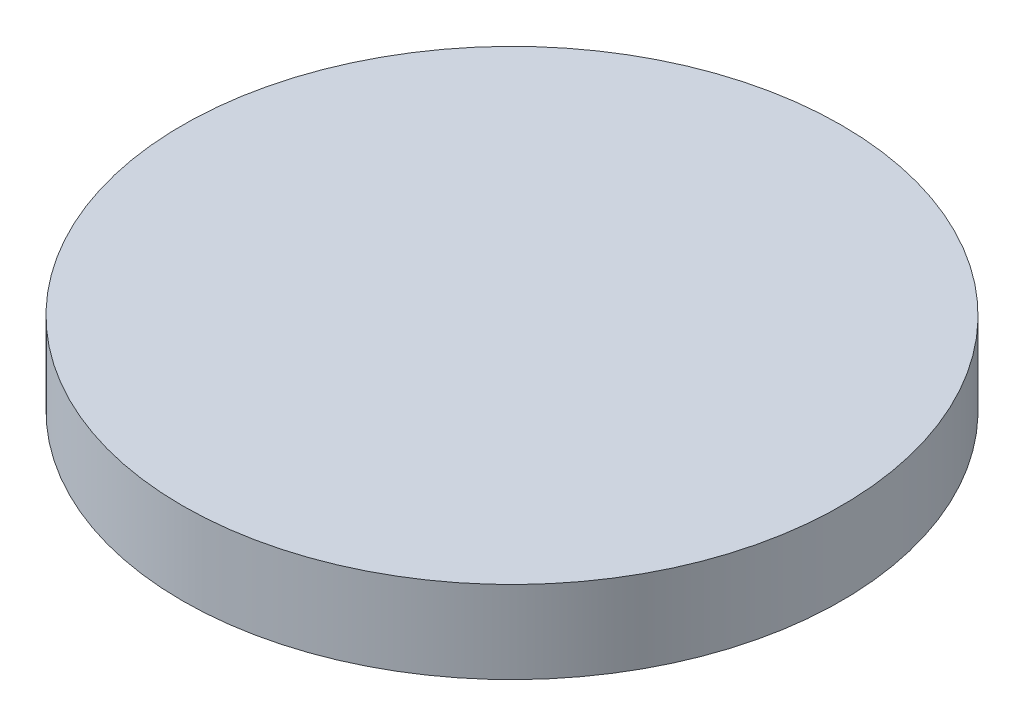
ISO-10303-21;
HEADER;
FILE_DESCRIPTION(('STEP AP214'),'2;1');
FILE_NAME('part.step','',(''),(''),'','','');
FILE_SCHEMA(('AUTOMOTIVE_DESIGN { 1 0 10303 214 1 1 1 1 }'));
ENDSEC;
DATA;
#1=APPLICATION_CONTEXT('core data for automotive mechanical design processes');
#2=APPLICATION_PROTOCOL_DEFINITION('international standard','automotive_design',2000,#1);
#3=PRODUCT_CONTEXT('',#1,'mechanical');
#4=PRODUCT('Part','Part','',(#3));
#5=PRODUCT_RELATED_PRODUCT_CATEGORY('part','',(#4));
#6=PRODUCT_DEFINITION_FORMATION('','',#4);
#7=PRODUCT_DEFINITION_CONTEXT('part definition',#1,'design');
#8=PRODUCT_DEFINITION('design','',#6,#7);
#9=PRODUCT_DEFINITION_SHAPE('','',#8);
#10=(LENGTH_UNIT() NAMED_UNIT(*) SI_UNIT(.MILLI.,.METRE.));
#11=(NAMED_UNIT(*) PLANE_ANGLE_UNIT() SI_UNIT($,.RADIAN.));
#12=(NAMED_UNIT(*) SI_UNIT($,.STERADIAN.) SOLID_ANGLE_UNIT());
#13=UNCERTAINTY_MEASURE_WITH_UNIT(LENGTH_MEASURE(1.E-05),#10,'distance_accuracy_value','');
#14=(GEOMETRIC_REPRESENTATION_CONTEXT(3) GLOBAL_UNCERTAINTY_ASSIGNED_CONTEXT((#13)) GLOBAL_UNIT_ASSIGNED_CONTEXT((#10,
#11,#12)) REPRESENTATION_CONTEXT('',''));
#15=CARTESIAN_POINT('',(0.,0.,0.));
#16=DIRECTION('',(0.,0.,1.));
#17=DIRECTION('',(1.,0.,0.));
#18=AXIS2_PLACEMENT_3D('',#15,#16,#17);
#19=CARTESIAN_POINT('',(-55.5229665005388,12.7,-32.2610508718727));
#20=DIRECTION('',(0.,-1.,0.));
#21=DIRECTION('',(0.,0.,-1.));
#22=AXIS2_PLACEMENT_3D('',#19,#20,#21);
#23=CYLINDRICAL_SURFACE('',#22,50.8);
#24=CARTESIAN_POINT('',(-55.5229665005388,12.7,-32.2610508718727));
#25=DIRECTION('',(0.,1.,0.));
#26=DIRECTION('',(0.,0.,1.));
#27=AXIS2_PLACEMENT_3D('',#24,#25,#26);
#28=CIRCLE('',#27,50.8);
#29=CARTESIAN_POINT('',(-55.5229665005388,12.7,18.5389491281273));
#30=VERTEX_POINT('',#29);
#31=EDGE_CURVE('E10',#30,#30,#28,.T.);
#32=ORIENTED_EDGE('',*,*,#31,.F.);
#33=EDGE_LOOP('',(#32));
#34=FACE_BOUND('',#33,.T.);
#35=CARTESIAN_POINT('',(-55.5229665005388,0.,-32.2610508718727));
#36=DIRECTION('',(0.,1.,0.));
#37=DIRECTION('',(0.,0.,1.));
#38=AXIS2_PLACEMENT_3D('',#35,#36,#37);
#39=CIRCLE('',#38,50.8);
#40=CARTESIAN_POINT('',(-55.5229665005388,0.,18.5389491281273));
#41=VERTEX_POINT('',#40);
#42=EDGE_CURVE('E34',#41,#41,#39,.T.);
#43=ORIENTED_EDGE('',*,*,#42,.T.);
#44=EDGE_LOOP('',(#43));
#45=FACE_BOUND('',#44,.T.);
#46=ADVANCED_FACE('F31',(#34,#45),#23,.T.);
#47=CARTESIAN_POINT('',(-55.5229665005388,12.7,-32.2610508718727));
#48=DIRECTION('',(0.,1.,0.));
#49=DIRECTION('',(0.,0.,1.));
#50=AXIS2_PLACEMENT_3D('',#47,#48,#49);
#51=PLANE('',#50);
#52=ORIENTED_EDGE('',*,*,#31,.T.);
#53=EDGE_LOOP('',(#52));
#54=FACE_BOUND('',#53,.T.);
#55=ADVANCED_FACE('F46',(#54),#51,.T.);
#56=CARTESIAN_POINT('',(-55.5229665005388,0.,-32.2610508718727));
#57=DIRECTION('',(0.,1.,0.));
#58=DIRECTION('',(0.,0.,1.));
#59=AXIS2_PLACEMENT_3D('',#56,#57,#58);
#60=PLANE('',#59);
#61=ORIENTED_EDGE('',*,*,#42,.F.);
#62=EDGE_LOOP('',(#61));
#63=FACE_BOUND('',#62,.T.);
#64=ADVANCED_FACE('F44',(#63),#60,.F.);
#65=CLOSED_SHELL('',(#46,#55,#64));
#66=MANIFOLD_SOLID_BREP('B2',#65);
#67=ADVANCED_BREP_SHAPE_REPRESENTATION('',(#18,#66),#14);
#68=SHAPE_DEFINITION_REPRESENTATION(#9,#67);
ENDSEC;
END-ISO-10303-21;
